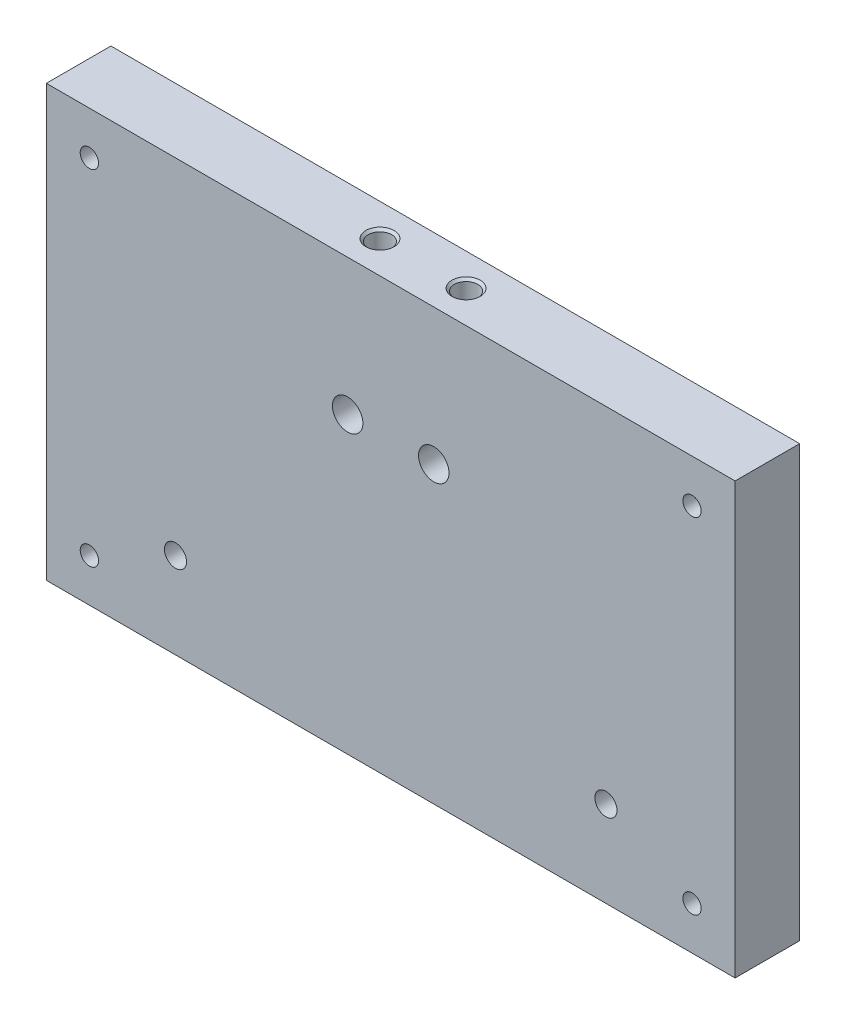
ISO-10303-21;
HEADER;
FILE_DESCRIPTION(('STEP AP214'),'2;1');
FILE_NAME('part.step','',(''),(''),'','','');
FILE_SCHEMA(('AUTOMOTIVE_DESIGN { 1 0 10303 214 1 1 1 1 }'));
ENDSEC;
DATA;
#1=APPLICATION_CONTEXT('core data for automotive mechanical design processes');
#2=APPLICATION_PROTOCOL_DEFINITION('international standard','automotive_design',2000,#1);
#3=PRODUCT_CONTEXT('',#1,'mechanical');
#4=PRODUCT('Part','Part','',(#3));
#5=PRODUCT_RELATED_PRODUCT_CATEGORY('part','',(#4));
#6=PRODUCT_DEFINITION_FORMATION('','',#4);
#7=PRODUCT_DEFINITION_CONTEXT('part definition',#1,'design');
#8=PRODUCT_DEFINITION('design','',#6,#7);
#9=PRODUCT_DEFINITION_SHAPE('','',#8);
#10=(LENGTH_UNIT() NAMED_UNIT(*) SI_UNIT(.MILLI.,.METRE.));
#11=(NAMED_UNIT(*) PLANE_ANGLE_UNIT() SI_UNIT($,.RADIAN.));
#12=(NAMED_UNIT(*) SI_UNIT($,.STERADIAN.) SOLID_ANGLE_UNIT());
#13=UNCERTAINTY_MEASURE_WITH_UNIT(LENGTH_MEASURE(1.E-05),#10,'distance_accuracy_value','');
#14=(GEOMETRIC_REPRESENTATION_CONTEXT(3) GLOBAL_UNCERTAINTY_ASSIGNED_CONTEXT((#13)) GLOBAL_UNIT_ASSIGNED_CONTEXT((#10,
#11,#12)) REPRESENTATION_CONTEXT('',''));
#15=CARTESIAN_POINT('',(0.,0.,0.));
#16=DIRECTION('',(0.,0.,1.));
#17=DIRECTION('',(1.,0.,0.));
#18=AXIS2_PLACEMENT_3D('',#15,#16,#17);
#19=CARTESIAN_POINT('',(0.,0.,9.525));
#20=DIRECTION('',(-1.,0.,0.));
#21=DIRECTION('',(0.,0.,1.));
#22=AXIS2_PLACEMENT_3D('',#19,#20,#21);
#23=PLANE('',#22);
#24=DIRECTION('',(0.,1.,0.));
#25=VECTOR('',#24,1.);
#26=CARTESIAN_POINT('',(0.,0.,0.));
#27=LINE('',#26,#25);
#28=CARTESIAN_POINT('',(0.,0.,0.));
#29=VERTEX_POINT('',#28);
#30=CARTESIAN_POINT('',(0.,63.5,0.));
#31=VERTEX_POINT('',#30);
#32=EDGE_CURVE('E107',#29,#31,#27,.T.);
#33=ORIENTED_EDGE('',*,*,#32,.T.);
#34=DIRECTION('',(0.,0.,-1.));
#35=VECTOR('',#34,1.);
#36=CARTESIAN_POINT('',(0.,63.5,9.525));
#37=LINE('',#36,#35);
#38=CARTESIAN_POINT('',(0.,63.5,9.525));
#39=VERTEX_POINT('',#38);
#40=EDGE_CURVE('E11',#39,#31,#37,.T.);
#41=ORIENTED_EDGE('',*,*,#40,.F.);
#42=DIRECTION('',(0.,1.,0.));
#43=VECTOR('',#42,1.);
#44=CARTESIAN_POINT('',(0.,0.,9.525));
#45=LINE('',#44,#43);
#46=CARTESIAN_POINT('',(0.,0.,9.525));
#47=VERTEX_POINT('',#46);
#48=EDGE_CURVE('E94',#47,#39,#45,.T.);
#49=ORIENTED_EDGE('',*,*,#48,.F.);
#50=DIRECTION('',(0.,0.,-1.));
#51=VECTOR('',#50,1.);
#52=CARTESIAN_POINT('',(0.,0.,9.525));
#53=LINE('',#52,#51);
#54=EDGE_CURVE('E103',#47,#29,#53,.T.);
#55=ORIENTED_EDGE('',*,*,#54,.T.);
#56=EDGE_LOOP('',(#33,#41,#49,#55));
#57=FACE_BOUND('',#56,.T.);
#58=ADVANCED_FACE('F37',(#57),#23,.F.);
#59=CARTESIAN_POINT('',(0.,63.5,9.525));
#60=DIRECTION('',(0.,-1.,0.));
#61=DIRECTION('',(1.,0.,0.));
#62=AXIS2_PLACEMENT_3D('',#59,#60,#61);
#63=PLANE('',#62);
#64=CARTESIAN_POINT('',(-44.45,63.5,4.7625));
#65=DIRECTION('',(0.,1.,0.));
#66=DIRECTION('',(0.,0.,1.));
#67=AXIS2_PLACEMENT_3D('',#64,#65,#66);
#68=CIRCLE('',#67,2.0828);
#69=CARTESIAN_POINT('',(-44.45,63.5,6.8453));
#70=VERTEX_POINT('',#69);
#71=EDGE_CURVE('E339',#70,#70,#68,.T.);
#72=ORIENTED_EDGE('',*,*,#71,.F.);
#73=EDGE_LOOP('',(#72));
#74=FACE_BOUND('',#73,.T.);
#75=CARTESIAN_POINT('',(-57.15,63.5,4.7625));
#76=DIRECTION('',(0.,1.,0.));
#77=DIRECTION('',(0.,0.,1.));
#78=AXIS2_PLACEMENT_3D('',#75,#76,#77);
#79=CIRCLE('',#78,2.0828);
#80=CARTESIAN_POINT('',(-57.15,63.5,6.8453));
#81=VERTEX_POINT('',#80);
#82=EDGE_CURVE('E345',#81,#81,#79,.T.);
#83=ORIENTED_EDGE('',*,*,#82,.F.);
#84=EDGE_LOOP('',(#83));
#85=FACE_BOUND('',#84,.T.);
#86=DIRECTION('',(-1.,0.,0.));
#87=VECTOR('',#86,1.);
#88=CARTESIAN_POINT('',(0.,63.5,0.));
#89=LINE('',#88,#87);
#90=CARTESIAN_POINT('',(-101.6,63.5,0.));
#91=VERTEX_POINT('',#90);
#92=EDGE_CURVE('E98',#31,#91,#89,.T.);
#93=ORIENTED_EDGE('',*,*,#92,.T.);
#94=DIRECTION('',(0.,0.,-1.));
#95=VECTOR('',#94,1.);
#96=CARTESIAN_POINT('',(-101.6,63.5,9.525));
#97=LINE('',#96,#95);
#98=CARTESIAN_POINT('',(-101.6,63.5,9.525));
#99=VERTEX_POINT('',#98);
#100=EDGE_CURVE('E50',#99,#91,#97,.T.);
#101=ORIENTED_EDGE('',*,*,#100,.F.);
#102=DIRECTION('',(-1.,0.,0.));
#103=VECTOR('',#102,1.);
#104=CARTESIAN_POINT('',(0.,63.5,9.525));
#105=LINE('',#104,#103);
#106=EDGE_CURVE('E89',#39,#99,#105,.T.);
#107=ORIENTED_EDGE('',*,*,#106,.F.);
#108=ORIENTED_EDGE('',*,*,#40,.T.);
#109=EDGE_LOOP('',(#93,#101,#107,#108));
#110=FACE_BOUND('',#109,.T.);
#111=ADVANCED_FACE('F97',(#74,#85,#110),#63,.F.);
#112=CARTESIAN_POINT('',(-101.6,0.,9.525));
#113=DIRECTION('',(1.,0.,0.));
#114=DIRECTION('',(0.,0.,-1.));
#115=AXIS2_PLACEMENT_3D('',#112,#113,#114);
#116=PLANE('',#115);
#117=DIRECTION('',(0.,-1.,0.));
#118=VECTOR('',#117,1.);
#119=CARTESIAN_POINT('',(-101.6,0.,0.));
#120=LINE('',#119,#118);
#121=CARTESIAN_POINT('',(-101.6,0.,0.));
#122=VERTEX_POINT('',#121);
#123=EDGE_CURVE('E76',#91,#122,#120,.T.);
#124=ORIENTED_EDGE('',*,*,#123,.T.);
#125=DIRECTION('',(0.,0.,-1.));
#126=VECTOR('',#125,1.);
#127=CARTESIAN_POINT('',(-101.6,0.,9.525));
#128=LINE('',#127,#126);
#129=CARTESIAN_POINT('',(-101.6,0.,9.525));
#130=VERTEX_POINT('',#129);
#131=EDGE_CURVE('E99',#130,#122,#128,.T.);
#132=ORIENTED_EDGE('',*,*,#131,.F.);
#133=DIRECTION('',(0.,-1.,0.));
#134=VECTOR('',#133,1.);
#135=CARTESIAN_POINT('',(-101.6,0.,9.525));
#136=LINE('',#135,#134);
#137=EDGE_CURVE('E92',#99,#130,#136,.T.);
#138=ORIENTED_EDGE('',*,*,#137,.F.);
#139=ORIENTED_EDGE('',*,*,#100,.T.);
#140=EDGE_LOOP('',(#124,#132,#138,#139));
#141=FACE_BOUND('',#140,.T.);
#142=ADVANCED_FACE('F101',(#141),#116,.F.);
#143=CARTESIAN_POINT('',(0.,0.,9.525));
#144=DIRECTION('',(0.,1.,0.));
#145=DIRECTION('',(-1.,0.,0.));
#146=AXIS2_PLACEMENT_3D('',#143,#144,#145);
#147=PLANE('',#146);
#148=DIRECTION('',(1.,0.,0.));
#149=VECTOR('',#148,1.);
#150=CARTESIAN_POINT('',(0.,0.,0.));
#151=LINE('',#150,#149);
#152=EDGE_CURVE('E82',#122,#29,#151,.T.);
#153=ORIENTED_EDGE('',*,*,#152,.T.);
#154=ORIENTED_EDGE('',*,*,#54,.F.);
#155=DIRECTION('',(1.,0.,0.));
#156=VECTOR('',#155,1.);
#157=CARTESIAN_POINT('',(0.,0.,9.525));
#158=LINE('',#157,#156);
#159=EDGE_CURVE('E59',#130,#47,#158,.T.);
#160=ORIENTED_EDGE('',*,*,#159,.F.);
#161=ORIENTED_EDGE('',*,*,#131,.T.);
#162=EDGE_LOOP('',(#153,#154,#160,#161));
#163=FACE_BOUND('',#162,.T.);
#164=ADVANCED_FACE('F166',(#163),#147,.F.);
#165=CARTESIAN_POINT('',(0.,0.,9.525));
#166=DIRECTION('',(0.,0.,1.));
#167=DIRECTION('',(1.,0.,0.));
#168=AXIS2_PLACEMENT_3D('',#165,#166,#167);
#169=PLANE('',#168);
#170=CARTESIAN_POINT('',(-82.55,12.7,9.525));
#171=DIRECTION('',(0.,0.,1.));
#172=DIRECTION('',(1.,0.,0.));
#173=AXIS2_PLACEMENT_3D('',#170,#171,#172);
#174=CIRCLE('',#173,1.63194999999999);
#175=CARTESIAN_POINT('',(-80.91805,12.7,9.525));
#176=VERTEX_POINT('',#175);
#177=EDGE_CURVE('E391',#176,#176,#174,.T.);
#178=ORIENTED_EDGE('',*,*,#177,.F.);
#179=EDGE_LOOP('',(#178));
#180=FACE_BOUND('',#179,.T.);
#181=CARTESIAN_POINT('',(-19.05,12.7,9.525));
#182=DIRECTION('',(0.,0.,1.));
#183=DIRECTION('',(1.,0.,0.));
#184=AXIS2_PLACEMENT_3D('',#181,#182,#183);
#185=CIRCLE('',#184,1.63195);
#186=CARTESIAN_POINT('',(-17.41805,12.7,9.525));
#187=VERTEX_POINT('',#186);
#188=EDGE_CURVE('E386',#187,#187,#185,.T.);
#189=ORIENTED_EDGE('',*,*,#188,.F.);
#190=EDGE_LOOP('',(#189));
#191=FACE_BOUND('',#190,.T.);
#192=CARTESIAN_POINT('',(-95.25,6.34999999999999,9.525));
#193=DIRECTION('',(0.,0.,1.));
#194=DIRECTION('',(1.,0.,0.));
#195=AXIS2_PLACEMENT_3D('',#192,#193,#194);
#196=CIRCLE('',#195,1.35254999999998);
#197=CARTESIAN_POINT('',(-93.89745,6.34999999999999,9.525));
#198=VERTEX_POINT('',#197);
#199=EDGE_CURVE('E380',#198,#198,#196,.T.);
#200=ORIENTED_EDGE('',*,*,#199,.F.);
#201=EDGE_LOOP('',(#200));
#202=FACE_BOUND('',#201,.T.);
#203=CARTESIAN_POINT('',(-95.25,57.15,9.525));
#204=DIRECTION('',(0.,0.,1.));
#205=DIRECTION('',(1.,0.,0.));
#206=AXIS2_PLACEMENT_3D('',#203,#204,#205);
#207=CIRCLE('',#206,1.35254999999998);
#208=CARTESIAN_POINT('',(-93.89745,57.15,9.525));
#209=VERTEX_POINT('',#208);
#210=EDGE_CURVE('E374',#209,#209,#207,.T.);
#211=ORIENTED_EDGE('',*,*,#210,.F.);
#212=EDGE_LOOP('',(#211));
#213=FACE_BOUND('',#212,.T.);
#214=CARTESIAN_POINT('',(-6.35,6.35,9.525));
#215=DIRECTION('',(0.,0.,1.));
#216=DIRECTION('',(1.,0.,0.));
#217=AXIS2_PLACEMENT_3D('',#214,#215,#216);
#218=CIRCLE('',#217,1.35254999999999);
#219=CARTESIAN_POINT('',(-4.99745000000001,6.35,9.525));
#220=VERTEX_POINT('',#219);
#221=EDGE_CURVE('E368',#220,#220,#218,.T.);
#222=ORIENTED_EDGE('',*,*,#221,.F.);
#223=EDGE_LOOP('',(#222));
#224=FACE_BOUND('',#223,.T.);
#225=CARTESIAN_POINT('',(-6.35,57.15,9.525));
#226=DIRECTION('',(0.,0.,1.));
#227=DIRECTION('',(1.,0.,0.));
#228=AXIS2_PLACEMENT_3D('',#225,#226,#227);
#229=CIRCLE('',#228,1.35254999999999);
#230=CARTESIAN_POINT('',(-4.99745000000001,57.15,9.525));
#231=VERTEX_POINT('',#230);
#232=EDGE_CURVE('E362',#231,#231,#229,.T.);
#233=ORIENTED_EDGE('',*,*,#232,.F.);
#234=EDGE_LOOP('',(#233));
#235=FACE_BOUND('',#234,.T.);
#236=CARTESIAN_POINT('',(-44.45,43.4121935388156,9.525));
#237=DIRECTION('',(0.,0.,1.));
#238=DIRECTION('',(1.,0.,0.));
#239=AXIS2_PLACEMENT_3D('',#236,#237,#238);
#240=CIRCLE('',#239,2.2479);
#241=CARTESIAN_POINT('',(-42.2021,43.4121935388156,9.525));
#242=VERTEX_POINT('',#241);
#243=EDGE_CURVE('E326',#242,#242,#240,.T.);
#244=ORIENTED_EDGE('',*,*,#243,.F.);
#245=EDGE_LOOP('',(#244));
#246=FACE_BOUND('',#245,.T.);
#247=CARTESIAN_POINT('',(-57.15,43.4121935388156,9.525));
#248=DIRECTION('',(0.,0.,1.));
#249=DIRECTION('',(1.,0.,0.));
#250=AXIS2_PLACEMENT_3D('',#247,#248,#249);
#251=CIRCLE('',#250,2.2479);
#252=CARTESIAN_POINT('',(-54.9021,43.4121935388156,9.525));
#253=VERTEX_POINT('',#252);
#254=EDGE_CURVE('E122',#253,#253,#251,.T.);
#255=ORIENTED_EDGE('',*,*,#254,.F.);
#256=EDGE_LOOP('',(#255));
#257=FACE_BOUND('',#256,.T.);
#258=ORIENTED_EDGE('',*,*,#48,.T.);
#259=ORIENTED_EDGE('',*,*,#106,.T.);
#260=ORIENTED_EDGE('',*,*,#137,.T.);
#261=ORIENTED_EDGE('',*,*,#159,.T.);
#262=EDGE_LOOP('',(#258,#259,#260,#261));
#263=FACE_BOUND('',#262,.T.);
#264=ADVANCED_FACE('F90',(#180,#191,#202,#213,#224,#235,#246,#257,#263),#169,.T.);
#265=CARTESIAN_POINT('',(0.,0.,0.));
#266=DIRECTION('',(0.,0.,1.));
#267=DIRECTION('',(1.,0.,0.));
#268=AXIS2_PLACEMENT_3D('',#265,#266,#267);
#269=PLANE('',#268);
#270=CARTESIAN_POINT('',(-82.55,12.7,0.));
#271=DIRECTION('',(0.,0.,1.));
#272=DIRECTION('',(1.,0.,0.));
#273=AXIS2_PLACEMENT_3D('',#270,#271,#272);
#274=CIRCLE('',#273,1.63194999999999);
#275=CARTESIAN_POINT('',(-80.91805,12.7,0.));
#276=VERTEX_POINT('',#275);
#277=EDGE_CURVE('E389',#276,#276,#274,.T.);
#278=ORIENTED_EDGE('',*,*,#277,.T.);
#279=EDGE_LOOP('',(#278));
#280=FACE_BOUND('',#279,.T.);
#281=CARTESIAN_POINT('',(-19.05,12.7,0.));
#282=DIRECTION('',(0.,0.,1.));
#283=DIRECTION('',(1.,0.,0.));
#284=AXIS2_PLACEMENT_3D('',#281,#282,#283);
#285=CIRCLE('',#284,1.63195);
#286=CARTESIAN_POINT('',(-17.41805,12.7,0.));
#287=VERTEX_POINT('',#286);
#288=EDGE_CURVE('E383',#287,#287,#285,.T.);
#289=ORIENTED_EDGE('',*,*,#288,.T.);
#290=EDGE_LOOP('',(#289));
#291=FACE_BOUND('',#290,.T.);
#292=CARTESIAN_POINT('',(-95.25,6.34999999999999,0.));
#293=DIRECTION('',(0.,0.,1.));
#294=DIRECTION('',(1.,0.,0.));
#295=AXIS2_PLACEMENT_3D('',#292,#293,#294);
#296=CIRCLE('',#295,1.35254999999999);
#297=CARTESIAN_POINT('',(-93.89745,6.34999999999999,0.));
#298=VERTEX_POINT('',#297);
#299=EDGE_CURVE('E377',#298,#298,#296,.T.);
#300=ORIENTED_EDGE('',*,*,#299,.T.);
#301=EDGE_LOOP('',(#300));
#302=FACE_BOUND('',#301,.T.);
#303=CARTESIAN_POINT('',(-95.25,57.15,0.));
#304=DIRECTION('',(0.,0.,1.));
#305=DIRECTION('',(1.,0.,0.));
#306=AXIS2_PLACEMENT_3D('',#303,#304,#305);
#307=CIRCLE('',#306,1.35254999999999);
#308=CARTESIAN_POINT('',(-93.89745,57.15,0.));
#309=VERTEX_POINT('',#308);
#310=EDGE_CURVE('E371',#309,#309,#307,.T.);
#311=ORIENTED_EDGE('',*,*,#310,.T.);
#312=EDGE_LOOP('',(#311));
#313=FACE_BOUND('',#312,.T.);
#314=CARTESIAN_POINT('',(-6.35,6.35,0.));
#315=DIRECTION('',(0.,0.,1.));
#316=DIRECTION('',(1.,0.,0.));
#317=AXIS2_PLACEMENT_3D('',#314,#315,#316);
#318=CIRCLE('',#317,1.35255);
#319=CARTESIAN_POINT('',(-4.99745,6.35,0.));
#320=VERTEX_POINT('',#319);
#321=EDGE_CURVE('E365',#320,#320,#318,.T.);
#322=ORIENTED_EDGE('',*,*,#321,.T.);
#323=EDGE_LOOP('',(#322));
#324=FACE_BOUND('',#323,.T.);
#325=CARTESIAN_POINT('',(-6.35,57.15,0.));
#326=DIRECTION('',(0.,0.,1.));
#327=DIRECTION('',(1.,0.,0.));
#328=AXIS2_PLACEMENT_3D('',#325,#326,#327);
#329=CIRCLE('',#328,1.35255);
#330=CARTESIAN_POINT('',(-4.99745,57.15,0.));
#331=VERTEX_POINT('',#330);
#332=EDGE_CURVE('E359',#331,#331,#329,.T.);
#333=ORIENTED_EDGE('',*,*,#332,.T.);
#334=EDGE_LOOP('',(#333));
#335=FACE_BOUND('',#334,.T.);
#336=CARTESIAN_POINT('',(-44.45,43.4121935388156,0.));
#337=DIRECTION('',(0.,0.,1.));
#338=DIRECTION('',(1.,0.,0.));
#339=AXIS2_PLACEMENT_3D('',#336,#337,#338);
#340=CIRCLE('',#339,2.2479);
#341=CARTESIAN_POINT('',(-42.2021,43.4121935388156,0.));
#342=VERTEX_POINT('',#341);
#343=EDGE_CURVE('E329',#342,#342,#340,.T.);
#344=ORIENTED_EDGE('',*,*,#343,.T.);
#345=EDGE_LOOP('',(#344));
#346=FACE_BOUND('',#345,.T.);
#347=CARTESIAN_POINT('',(-57.15,43.4121935388156,0.));
#348=DIRECTION('',(0.,0.,1.));
#349=DIRECTION('',(1.,0.,0.));
#350=AXIS2_PLACEMENT_3D('',#347,#348,#349);
#351=CIRCLE('',#350,2.2479);
#352=CARTESIAN_POINT('',(-54.9021,43.4121935388156,0.));
#353=VERTEX_POINT('',#352);
#354=EDGE_CURVE('E121',#353,#353,#351,.T.);
#355=ORIENTED_EDGE('',*,*,#354,.T.);
#356=EDGE_LOOP('',(#355));
#357=FACE_BOUND('',#356,.T.);
#358=ORIENTED_EDGE('',*,*,#32,.F.);
#359=ORIENTED_EDGE('',*,*,#152,.F.);
#360=ORIENTED_EDGE('',*,*,#123,.F.);
#361=ORIENTED_EDGE('',*,*,#92,.F.);
#362=EDGE_LOOP('',(#358,#359,#360,#361));
#363=FACE_BOUND('',#362,.T.);
#364=ADVANCED_FACE('F148',(#280,#291,#302,#313,#324,#335,#346,#357,#363),#269,.F.);
#365=CARTESIAN_POINT('',(-57.15,63.5,4.7625));
#366=DIRECTION('',(0.,1.,0.));
#367=DIRECTION('',(0.,0.,1.));
#368=AXIS2_PLACEMENT_3D('',#365,#366,#367);
#369=CYLINDRICAL_SURFACE('',#368,1.7272);
#370=CARTESIAN_POINT('',(-57.15,45.6600935388156,6.4897));
#371=CARTESIAN_POINT('',(-57.2338587410568,45.660086904255,6.48969312604297));
#372=CARTESIAN_POINT('',(-57.3178007097025,45.6553545921181,6.48354623436465));
#373=CARTESIAN_POINT('',(-57.482983545752,45.6368544226834,6.45936168885248));
#374=CARTESIAN_POINT('',(-57.564219807188,45.6230719102294,6.4413047486447));
#375=CARTESIAN_POINT('',(-57.7212109052852,45.5877880246278,6.39455705136511));
#376=CARTESIAN_POINT('',(-57.7969948117855,45.5663319025046,6.36592860262387));
#377=CARTESIAN_POINT('',(-57.9421572992914,45.5172873642362,6.29940904803436));
#378=CARTESIAN_POINT('',(-58.0115362630018,45.4896993148187,6.26151849610453));
#379=CARTESIAN_POINT('',(-58.1493250995929,45.4272979612141,6.17383002268563));
#380=CARTESIAN_POINT('',(-58.2170357260977,45.3920499657781,6.12324928318421));
#381=CARTESIAN_POINT('',(-58.3435539193056,45.3184601313201,6.01376408652045));
#382=CARTESIAN_POINT('',(-58.4023483646323,45.2801138574619,5.95484760379498));
#383=CARTESIAN_POINT('',(-58.522282918305,45.1944409174577,5.81615065068791));
#384=CARTESIAN_POINT('',(-58.5812575240503,45.1469404095441,5.734598701262));
#385=CARTESIAN_POINT('',(-58.6849513562198,45.0558815988741,5.56084877572078));
#386=CARTESIAN_POINT('',(-58.7296874065091,45.0123186874931,5.46866354045663));
#387=CARTESIAN_POINT('',(-58.7900606235057,44.9498654563105,5.30832591115649));
#388=CARTESIAN_POINT('',(-58.8103917039639,44.9277024329169,5.24323328028774));
#389=CARTESIAN_POINT('',(-58.8434460374248,44.8906769691249,5.10920362861217));
#390=CARTESIAN_POINT('',(-58.8561871439236,44.8757974110462,5.04027604988117));
#391=CARTESIAN_POINT('',(-58.8732615259641,44.8556672049597,4.89916501610035));
#392=CARTESIAN_POINT('',(-58.877505063932,44.8505193590108,4.82695496306086));
#393=CARTESIAN_POINT('',(-58.876860526688,44.8512929576657,4.68262666503324));
#394=CARTESIAN_POINT('',(-58.8719716244093,44.8572154048352,4.6105084289523));
#395=CARTESIAN_POINT('',(-58.8547260577637,44.877492682559,4.4778045949731));
#396=CARTESIAN_POINT('',(-58.8433719539129,44.8907092527734,4.4168988562289));
#397=CARTESIAN_POINT('',(-58.8147154393665,44.9229029254255,4.29808359641079));
#398=CARTESIAN_POINT('',(-58.7974065878164,44.9418862627797,4.24017739809542));
#399=CARTESIAN_POINT('',(-58.7443913991846,44.9975131251712,4.09102316987051));
#400=CARTESIAN_POINT('',(-58.7040534442491,45.0375919011801,4.00270760117155));
#401=CARTESIAN_POINT('',(-58.6104866123808,45.1221761162231,3.83545283073585));
#402=CARTESIAN_POINT('',(-58.5572249998136,45.1666926245992,3.75653821068905));
#403=CARTESIAN_POINT('',(-58.436588888252,45.2570819785916,3.60599680895956));
#404=CARTESIAN_POINT('',(-58.368814115099,45.3029521909512,3.53468774975973));
#405=CARTESIAN_POINT('',(-58.2207196149448,45.3905760055162,3.40363199358154));
#406=CARTESIAN_POINT('',(-58.1404227111641,45.4323368760179,3.34386469531415));
#407=CARTESIAN_POINT('',(-57.9837738505528,45.5011643912926,3.24761678211482));
#408=CARTESIAN_POINT('',(-57.9093850147246,45.5295216417677,3.2088764756708));
#409=CARTESIAN_POINT('',(-57.7537035464139,45.5790464814958,3.1420301183691));
#410=CARTESIAN_POINT('',(-57.672414838484,45.6002181240198,3.11391807128019));
#411=CARTESIAN_POINT('',(-57.5041740263861,45.6336825126222,3.06975411346075));
#412=CARTESIAN_POINT('',(-57.4171861503527,45.645911843363,3.05378830745377));
#413=CARTESIAN_POINT('',(-57.2409694820482,45.6599863863113,3.0354288236251));
#414=CARTESIAN_POINT('',(-57.1517421166426,45.6618380498904,3.03302671380071));
#415=CARTESIAN_POINT('',(-56.9846886385171,45.6553836480959,3.04143338103207));
#416=CARTESIAN_POINT('',(-56.906735318567,45.6482253820798,3.05074927760055));
#417=CARTESIAN_POINT('',(-56.7538588527044,45.6262603266978,3.0795431434207));
#418=CARTESIAN_POINT('',(-56.6789362245479,45.6114522363556,3.09902284119669));
#419=CARTESIAN_POINT('',(-56.5325065585192,45.5749599305833,3.14757439599706));
#420=CARTESIAN_POINT('',(-56.4610853070559,45.553156710711,3.17681264533635));
#421=CARTESIAN_POINT('',(-56.3242519629292,45.504197937889,3.24356561007769));
#422=CARTESIAN_POINT('',(-56.2588408629212,45.477041503107,3.28108168920411));
#423=CARTESIAN_POINT('',(-56.124585956842,45.4141731411896,3.36993637006007));
#424=CARTESIAN_POINT('',(-56.056890699999,45.3777877654858,3.42252850178317));
#425=CARTESIAN_POINT('',(-55.9307257199699,45.3021277922577,3.53619762696585));
#426=CARTESIAN_POINT('',(-55.8722732112681,45.2628479987523,3.59729006354027));
#427=CARTESIAN_POINT('',(-55.7538717457043,45.1758023187386,3.74054577584215));
#428=CARTESIAN_POINT('',(-55.6960902118931,45.1279535396926,3.82445799456166));
#429=CARTESIAN_POINT('',(-55.5952965394909,45.0371616109442,4.00315408040512));
#430=CARTESIAN_POINT('',(-55.5522577439943,44.9942097018897,4.09791790774282));
#431=CARTESIAN_POINT('',(-55.4960855545295,44.9348966925771,4.26037216706615));
#432=CARTESIAN_POINT('',(-55.4777934504767,44.9146122858317,4.32482580212366));
#433=CARTESIAN_POINT('',(-55.4486549094326,44.8815363831526,4.45718781226999));
#434=CARTESIAN_POINT('',(-55.437790339149,44.868726650132,4.52508733574435));
#435=CARTESIAN_POINT('',(-55.4242295328618,44.8526434317699,4.66350200606323));
#436=CARTESIAN_POINT('',(-55.4216066863791,44.8494556360684,4.73403502512876));
#437=CARTESIAN_POINT('',(-55.4250060378156,44.8535307464002,4.87460523288236));
#438=CARTESIAN_POINT('',(-55.4310337168646,44.8608002783929,4.94464207892254));
#439=CARTESIAN_POINT('',(-55.4523003610492,44.8856771345953,5.0896087014841));
#440=CARTESIAN_POINT('',(-55.4684978596906,44.9043538508375,5.16420452961272));
#441=CARTESIAN_POINT('',(-55.5096478847757,44.9494724340902,5.3085105132186));
#442=CARTESIAN_POINT('',(-55.534623659396,44.9759348900524,5.3782070996473));
#443=CARTESIAN_POINT('',(-55.6044511043617,45.0454898069933,5.54048662174001));
#444=CARTESIAN_POINT('',(-55.6532443092734,45.0908958038255,5.63036770098031));
#445=CARTESIAN_POINT('',(-55.764968416866,45.184218708349,5.79941089060643));
#446=CARTESIAN_POINT('',(-55.8279180031055,45.2321388695563,5.87855861179797));
#447=CARTESIAN_POINT('',(-55.9689246554768,45.3267394144311,6.02700582011919));
#448=CARTESIAN_POINT('',(-56.0472743747089,45.3733718020639,6.09606024449322));
#449=CARTESIAN_POINT('',(-56.2175828887103,45.4598070961633,6.22018922962522));
#450=CARTESIAN_POINT('',(-56.3095116740699,45.4996246546895,6.27529390818552));
#451=CARTESIAN_POINT('',(-56.4793467049826,45.5590761469812,6.35617532596232));
#452=CARTESIAN_POINT('',(-56.5545075552948,45.5812624020037,6.3858542615825));
#453=CARTESIAN_POINT('',(-56.7098827532914,45.6180224318158,6.43465663578117));
#454=CARTESIAN_POINT('',(-56.7900856065726,45.6326128647271,6.45380317784225));
#455=CARTESIAN_POINT('',(-56.9174756623903,45.6485131486866,6.47460723441107));
#456=CARTESIAN_POINT('',(-56.9636789570766,45.6528415514883,6.48025286575565));
#457=CARTESIAN_POINT('',(-57.0565794813871,45.6586339250205,6.48780159493144));
#458=CARTESIAN_POINT('',(-57.103276822393,45.6600972353623,6.48970382993008));
#459=CARTESIAN_POINT('',(-57.15,45.6600935388156,6.4897));
#460=B_SPLINE_CURVE_WITH_KNOTS('',3,(#370,#371,#372,#373,#374,#375,#376,#377,#378,#379,#380,
#381,#382,#383,#384,#385,#386,#387,#388,#389,#390,#391,#392,#393,#394,#395,#396,#397,#398,#399,
#400,#401,#402,#403,#404,#405,#406,#407,#408,#409,#410,#411,#412,#413,#414,#415,#416,#417,#418,
#419,#420,#421,#422,#423,#424,#425,#426,#427,#428,#429,#430,#431,#432,#433,#434,#435,#436,#437,
#438,#439,#440,#441,#442,#443,#444,#445,#446,#447,#448,#449,#450,#451,#452,#453,#454,#455,#456,
#457,#458,#459),.UNSPECIFIED.,.T.,.F.,(4,2,2,2,2,2,2,2,2,2,2,2,2,2,2,2,2,2,2,2,2,2,2,2,2,2,2,2,
2,2,2,2,2,2,2,2,2,2,2,2,2,2,2,2,4),(0.,0.251377647963262,0.503163363560239,0.753488147133667,
1.00379796373903,1.27754956594077,1.5517002010665,1.88421693999147,2.2163393155103,
2.43076881398845,2.64469190889993,2.8608624450495,3.0770525593315,3.26640057633202,
3.45595404577309,3.76934397398978,4.08353616146981,4.40787661631742,4.73163268232424,
4.9961925240482,5.26060288337365,5.52687061759846,5.79297280567576,6.02835979102068,
6.26378682091261,6.50345272550828,6.74315814318815,7.02153345723681,7.3004212848789,
7.63670071162247,7.97236884888696,8.18168109612678,8.39048049402958,8.6011339804731,
8.8119209997279,9.04638269788552,9.28147007670804,9.61542353060051,9.94982034944547,
10.2913243064109,10.632084536869,10.8824876559646,11.1323392868577,11.2723659088719,
11.4124248024853),.UNSPECIFIED.);
#461=CARTESIAN_POINT('',(-57.15,45.6600935388156,6.4897));
#462=VERTEX_POINT('',#461);
#463=EDGE_CURVE('E115',#462,#462,#460,.T.);
#464=ORIENTED_EDGE('',*,*,#463,.T.);
#465=EDGE_LOOP('',(#464));
#466=FACE_BOUND('',#465,.T.);
#467=CARTESIAN_POINT('',(-57.15,63.1444,4.7625));
#468=DIRECTION('',(0.,1.,0.));
#469=DIRECTION('',(0.,0.,1.));
#470=AXIS2_PLACEMENT_3D('',#467,#468,#469);
#471=CIRCLE('',#470,1.7272);
#472=CARTESIAN_POINT('',(-57.15,63.1444,6.4897));
#473=VERTEX_POINT('',#472);
#474=EDGE_CURVE('E110',#473,#473,#471,.T.);
#475=ORIENTED_EDGE('',*,*,#474,.T.);
#476=EDGE_LOOP('',(#475));
#477=FACE_BOUND('',#476,.T.);
#478=ADVANCED_FACE('F123',(#466,#477),#369,.F.);
#479=CARTESIAN_POINT('',(-57.15,63.5,4.7625));
#480=DIRECTION('',(0.,1.,0.));
#481=DIRECTION('',(0.,0.,1.));
#482=AXIS2_PLACEMENT_3D('',#479,#480,#481);
#483=CONICAL_SURFACE('',#482,2.0828,0.785398163397458);
#484=ORIENTED_EDGE('',*,*,#474,.F.);
#485=EDGE_LOOP('',(#484));
#486=FACE_BOUND('',#485,.T.);
#487=ORIENTED_EDGE('',*,*,#82,.T.);
#488=EDGE_LOOP('',(#487));
#489=FACE_BOUND('',#488,.T.);
#490=ADVANCED_FACE('F141',(#486,#489),#483,.F.);
#491=CARTESIAN_POINT('',(-44.45,63.5,4.7625));
#492=DIRECTION('',(0.,1.,0.));
#493=DIRECTION('',(0.,0.,1.));
#494=AXIS2_PLACEMENT_3D('',#491,#492,#493);
#495=CYLINDRICAL_SURFACE('',#494,1.7272);
#496=CARTESIAN_POINT('',(-44.45,45.6600935388156,6.4897));
#497=CARTESIAN_POINT('',(-44.5338587410568,45.660086904255,6.48969312604296));
#498=CARTESIAN_POINT('',(-44.6178007097025,45.6553545921181,6.48354623436465));
#499=CARTESIAN_POINT('',(-44.782983545752,45.6368544226835,6.45936168885248));
#500=CARTESIAN_POINT('',(-44.864219807188,45.6230719102294,6.4413047486447));
#501=CARTESIAN_POINT('',(-45.0212109052852,45.5877880246278,6.39455705136511));
#502=CARTESIAN_POINT('',(-45.0969948117855,45.5663319025047,6.36592860262387));
#503=CARTESIAN_POINT('',(-45.2421572992914,45.5172873642362,6.29940904803436));
#504=CARTESIAN_POINT('',(-45.3115362630018,45.4896993148187,6.26151849610452));
#505=CARTESIAN_POINT('',(-45.4493250995929,45.4272979612142,6.17383002268563));
#506=CARTESIAN_POINT('',(-45.5170357260977,45.3920499657781,6.12324928318421));
#507=CARTESIAN_POINT('',(-45.6435539193056,45.3184601313201,6.01376408652045));
#508=CARTESIAN_POINT('',(-45.7023483646323,45.280113857462,5.95484760379497));
#509=CARTESIAN_POINT('',(-45.822282918305,45.1944409174577,5.81615065068791));
#510=CARTESIAN_POINT('',(-45.8812575240503,45.1469404095441,5.734598701262));
#511=CARTESIAN_POINT('',(-45.9849513562198,45.0558815988741,5.56084877572078));
#512=CARTESIAN_POINT('',(-46.0296874065091,45.0123186874931,5.46866354045663));
#513=CARTESIAN_POINT('',(-46.0900606235057,44.9498654563105,5.30832591115649));
#514=CARTESIAN_POINT('',(-46.1103917039639,44.9277024329169,5.24323328028774));
#515=CARTESIAN_POINT('',(-46.1434460374248,44.8906769691249,5.10920362861217));
#516=CARTESIAN_POINT('',(-46.1561871439236,44.8757974110462,5.04027604988117));
#517=CARTESIAN_POINT('',(-46.1732615259641,44.8556672049597,4.89916501610035));
#518=CARTESIAN_POINT('',(-46.177505063932,44.8505193590108,4.82695496306085));
#519=CARTESIAN_POINT('',(-46.176860526688,44.8512929576657,4.68262666503324));
#520=CARTESIAN_POINT('',(-46.1719716244093,44.8572154048352,4.61050842895229));
#521=CARTESIAN_POINT('',(-46.1547260577637,44.877492682559,4.47780459497309));
#522=CARTESIAN_POINT('',(-46.1433719539128,44.8907092527734,4.41689885622889));
#523=CARTESIAN_POINT('',(-46.1147154393665,44.9229029254255,4.29808359641079));
#524=CARTESIAN_POINT('',(-46.0974065878164,44.9418862627797,4.24017739809542));
#525=CARTESIAN_POINT('',(-46.0443913991846,44.9975131251712,4.09102316987051));
#526=CARTESIAN_POINT('',(-46.0040534442491,45.0375919011801,4.00270760117155));
#527=CARTESIAN_POINT('',(-45.9104866123808,45.1221761162232,3.83545283073585));
#528=CARTESIAN_POINT('',(-45.8572249998136,45.1666926245992,3.75653821068904));
#529=CARTESIAN_POINT('',(-45.736588888252,45.2570819785916,3.60599680895956));
#530=CARTESIAN_POINT('',(-45.668814115099,45.3029521909512,3.53468774975973));
#531=CARTESIAN_POINT('',(-45.5207196149448,45.3905760055162,3.40363199358154));
#532=CARTESIAN_POINT('',(-45.4404227111641,45.4323368760179,3.34386469531415));
#533=CARTESIAN_POINT('',(-45.2837738505528,45.5011643912926,3.24761678211482));
#534=CARTESIAN_POINT('',(-45.2093850147246,45.5295216417677,3.20887647567079));
#535=CARTESIAN_POINT('',(-45.0537035464139,45.5790464814959,3.14203011836909));
#536=CARTESIAN_POINT('',(-44.972414838484,45.6002181240198,3.11391807128019));
#537=CARTESIAN_POINT('',(-44.8041740263861,45.6336825126222,3.06975411346075));
#538=CARTESIAN_POINT('',(-44.7171861503527,45.645911843363,3.05378830745376));
#539=CARTESIAN_POINT('',(-44.5409694820482,45.6599863863113,3.0354288236251));
#540=CARTESIAN_POINT('',(-44.4517421166426,45.6618380498904,3.0330267138007));
#541=CARTESIAN_POINT('',(-44.2846886385171,45.6553836480959,3.04143338103206));
#542=CARTESIAN_POINT('',(-44.2067353185669,45.6482253820798,3.05074927760055));
#543=CARTESIAN_POINT('',(-44.0538588527044,45.6262603266979,3.07954314342069));
#544=CARTESIAN_POINT('',(-43.9789362245479,45.6114522363556,3.09902284119669));
#545=CARTESIAN_POINT('',(-43.8325065585192,45.5749599305834,3.14757439599706));
#546=CARTESIAN_POINT('',(-43.7610853070559,45.553156710711,3.17681264533634));
#547=CARTESIAN_POINT('',(-43.6242519629292,45.504197937889,3.24356561007769));
#548=CARTESIAN_POINT('',(-43.5588408629212,45.477041503107,3.28108168920411));
#549=CARTESIAN_POINT('',(-43.424585956842,45.4141731411896,3.36993637006007));
#550=CARTESIAN_POINT('',(-43.356890699999,45.3777877654858,3.42252850178317));
#551=CARTESIAN_POINT('',(-43.2307257199699,45.3021277922577,3.53619762696585));
#552=CARTESIAN_POINT('',(-43.1722732112681,45.2628479987523,3.59729006354027));
#553=CARTESIAN_POINT('',(-43.0538717457043,45.1758023187386,3.74054577584214));
#554=CARTESIAN_POINT('',(-42.9960902118931,45.1279535396927,3.82445799456166));
#555=CARTESIAN_POINT('',(-42.8952965394909,45.0371616109442,4.00315408040512));
#556=CARTESIAN_POINT('',(-42.8522577439943,44.9942097018897,4.09791790774282));
#557=CARTESIAN_POINT('',(-42.7960855545295,44.9348966925771,4.26037216706615));
#558=CARTESIAN_POINT('',(-42.7777934504767,44.9146122858317,4.32482580212366));
#559=CARTESIAN_POINT('',(-42.7486549094326,44.8815363831526,4.45718781226999));
#560=CARTESIAN_POINT('',(-42.737790339149,44.868726650132,4.52508733574434));
#561=CARTESIAN_POINT('',(-42.7242295328618,44.8526434317699,4.66350200606322));
#562=CARTESIAN_POINT('',(-42.7216066863791,44.8494556360684,4.73403502512875));
#563=CARTESIAN_POINT('',(-42.7250060378156,44.8535307464003,4.87460523288236));
#564=CARTESIAN_POINT('',(-42.7310337168646,44.8608002783929,4.94464207892254));
#565=CARTESIAN_POINT('',(-42.7523003610492,44.8856771345954,5.08960870148409));
#566=CARTESIAN_POINT('',(-42.7684978596906,44.9043538508375,5.16420452961272));
#567=CARTESIAN_POINT('',(-42.8096478847757,44.9494724340902,5.3085105132186));
#568=CARTESIAN_POINT('',(-42.834623659396,44.9759348900524,5.3782070996473));
#569=CARTESIAN_POINT('',(-42.9044511043617,45.0454898069933,5.54048662174001));
#570=CARTESIAN_POINT('',(-42.9532443092734,45.0908958038255,5.63036770098031));
#571=CARTESIAN_POINT('',(-43.064968416866,45.184218708349,5.79941089060643));
#572=CARTESIAN_POINT('',(-43.1279180031055,45.2321388695564,5.87855861179796));
#573=CARTESIAN_POINT('',(-43.2689246554768,45.3267394144311,6.02700582011919));
#574=CARTESIAN_POINT('',(-43.3472743747089,45.373371802064,6.09606024449321));
#575=CARTESIAN_POINT('',(-43.5175828887103,45.4598070961633,6.22018922962521));
#576=CARTESIAN_POINT('',(-43.6095116740699,45.4996246546895,6.27529390818552));
#577=CARTESIAN_POINT('',(-43.7793467049826,45.5590761469812,6.35617532596232));
#578=CARTESIAN_POINT('',(-43.8545075552948,45.5812624020037,6.3858542615825));
#579=CARTESIAN_POINT('',(-44.0098827532914,45.6180224318158,6.43465663578117));
#580=CARTESIAN_POINT('',(-44.0900856065726,45.6326128647271,6.45380317784224));
#581=CARTESIAN_POINT('',(-44.2174756623902,45.6485131486866,6.47460723441107));
#582=CARTESIAN_POINT('',(-44.2636789570766,45.6528415514883,6.48025286575565));
#583=CARTESIAN_POINT('',(-44.3565794813871,45.6586339250205,6.48780159493144));
#584=CARTESIAN_POINT('',(-44.403276822393,45.6600972353623,6.48970382993008));
#585=CARTESIAN_POINT('',(-44.45,45.6600935388156,6.4897));
#586=B_SPLINE_CURVE_WITH_KNOTS('',3,(#496,#497,#498,#499,#500,#501,#502,#503,#504,#505,#506,
#507,#508,#509,#510,#511,#512,#513,#514,#515,#516,#517,#518,#519,#520,#521,#522,#523,#524,#525,
#526,#527,#528,#529,#530,#531,#532,#533,#534,#535,#536,#537,#538,#539,#540,#541,#542,#543,#544,
#545,#546,#547,#548,#549,#550,#551,#552,#553,#554,#555,#556,#557,#558,#559,#560,#561,#562,#563,
#564,#565,#566,#567,#568,#569,#570,#571,#572,#573,#574,#575,#576,#577,#578,#579,#580,#581,#582,
#583,#584,#585),.UNSPECIFIED.,.T.,.F.,(4,2,2,2,2,2,2,2,2,2,2,2,2,2,2,2,2,2,2,2,2,2,2,2,2,2,2,2,
2,2,2,2,2,2,2,2,2,2,2,2,2,2,2,2,4),(0.,0.251377647963262,0.503163363560239,0.753488147133667,
1.00379796373903,1.27754956594076,1.5517002010665,1.88421693999147,2.2163393155103,
2.43076881398845,2.64469190889993,2.8608624450495,3.0770525593315,3.26640057633203,
3.45595404577309,3.76934397398977,4.08353616146981,4.40787661631742,4.73163268232424,
4.99619252404821,5.26060288337365,5.52687061759846,5.79297280567576,6.02835979102068,
6.2637868209126,6.50345272550828,6.74315814318814,7.02153345723681,7.30042128487889,
7.63670071162247,7.97236884888696,8.18168109612678,8.39048049402958,8.6011339804731,
8.8119209997279,9.04638269788552,9.28147007670804,9.61542353060051,9.94982034944547,
10.2913243064109,10.632084536869,10.8824876559646,11.1323392868577,11.2723659088719,
11.4124248024853),.UNSPECIFIED.);
#587=CARTESIAN_POINT('',(-44.45,45.6600935388156,6.4897));
#588=VERTEX_POINT('',#587);
#589=EDGE_CURVE('E40',#588,#588,#586,.T.);
#590=ORIENTED_EDGE('',*,*,#589,.T.);
#591=EDGE_LOOP('',(#590));
#592=FACE_BOUND('',#591,.T.);
#593=CARTESIAN_POINT('',(-44.45,63.1444,4.7625));
#594=DIRECTION('',(0.,1.,0.));
#595=DIRECTION('',(0.,0.,1.));
#596=AXIS2_PLACEMENT_3D('',#593,#594,#595);
#597=CIRCLE('',#596,1.7272);
#598=CARTESIAN_POINT('',(-44.45,63.1444,6.4897));
#599=VERTEX_POINT('',#598);
#600=EDGE_CURVE('E342',#599,#599,#597,.T.);
#601=ORIENTED_EDGE('',*,*,#600,.T.);
#602=EDGE_LOOP('',(#601));
#603=FACE_BOUND('',#602,.T.);
#604=ADVANCED_FACE('F137',(#592,#603),#495,.F.);
#605=CARTESIAN_POINT('',(-44.45,63.5,4.7625));
#606=DIRECTION('',(0.,1.,0.));
#607=DIRECTION('',(0.,0.,1.));
#608=AXIS2_PLACEMENT_3D('',#605,#606,#607);
#609=CONICAL_SURFACE('',#608,2.0828,0.785398163397439);
#610=ORIENTED_EDGE('',*,*,#600,.F.);
#611=EDGE_LOOP('',(#610));
#612=FACE_BOUND('',#611,.T.);
#613=ORIENTED_EDGE('',*,*,#71,.T.);
#614=EDGE_LOOP('',(#613));
#615=FACE_BOUND('',#614,.T.);
#616=ADVANCED_FACE('F132',(#612,#615),#609,.F.);
#617=CARTESIAN_POINT('',(-57.15,43.4121935388156,9.525));
#618=DIRECTION('',(0.,0.,1.));
#619=DIRECTION('',(1.,0.,0.));
#620=AXIS2_PLACEMENT_3D('',#617,#618,#619);
#621=CYLINDRICAL_SURFACE('',#620,2.2479);
#622=ORIENTED_EDGE('',*,*,#463,.F.);
#623=EDGE_LOOP('',(#622));
#624=FACE_BOUND('',#623,.T.);
#625=ORIENTED_EDGE('',*,*,#254,.T.);
#626=EDGE_LOOP('',(#625));
#627=FACE_BOUND('',#626,.T.);
#628=ORIENTED_EDGE('',*,*,#354,.F.);
#629=EDGE_LOOP('',(#628));
#630=FACE_BOUND('',#629,.T.);
#631=ADVANCED_FACE('F127',(#624,#627,#630),#621,.F.);
#632=CARTESIAN_POINT('',(-44.45,43.4121935388156,9.525));
#633=DIRECTION('',(0.,0.,1.));
#634=DIRECTION('',(1.,0.,0.));
#635=AXIS2_PLACEMENT_3D('',#632,#633,#634);
#636=CYLINDRICAL_SURFACE('',#635,2.2479);
#637=ORIENTED_EDGE('',*,*,#589,.F.);
#638=EDGE_LOOP('',(#637));
#639=FACE_BOUND('',#638,.T.);
#640=ORIENTED_EDGE('',*,*,#243,.T.);
#641=EDGE_LOOP('',(#640));
#642=FACE_BOUND('',#641,.T.);
#643=ORIENTED_EDGE('',*,*,#343,.F.);
#644=EDGE_LOOP('',(#643));
#645=FACE_BOUND('',#644,.T.);
#646=ADVANCED_FACE('F131',(#639,#642,#645),#636,.F.);
#647=CARTESIAN_POINT('',(-6.35,57.15,9.525));
#648=DIRECTION('',(0.,0.,1.));
#649=DIRECTION('',(1.,0.,0.));
#650=AXIS2_PLACEMENT_3D('',#647,#648,#649);
#651=CYLINDRICAL_SURFACE('',#650,1.35254999999999);
#652=ORIENTED_EDGE('',*,*,#332,.F.);
#653=EDGE_LOOP('',(#652));
#654=FACE_BOUND('',#653,.T.);
#655=ORIENTED_EDGE('',*,*,#232,.T.);
#656=EDGE_LOOP('',(#655));
#657=FACE_BOUND('',#656,.T.);
#658=ADVANCED_FACE('F225',(#654,#657),#651,.F.);
#659=CARTESIAN_POINT('',(-6.35,6.35,9.525));
#660=DIRECTION('',(0.,0.,1.));
#661=DIRECTION('',(1.,0.,0.));
#662=AXIS2_PLACEMENT_3D('',#659,#660,#661);
#663=CYLINDRICAL_SURFACE('',#662,1.35254999999999);
#664=ORIENTED_EDGE('',*,*,#321,.F.);
#665=EDGE_LOOP('',(#664));
#666=FACE_BOUND('',#665,.T.);
#667=ORIENTED_EDGE('',*,*,#221,.T.);
#668=EDGE_LOOP('',(#667));
#669=FACE_BOUND('',#668,.T.);
#670=ADVANCED_FACE('F230',(#666,#669),#663,.F.);
#671=CARTESIAN_POINT('',(-95.25,57.15,9.525));
#672=DIRECTION('',(0.,0.,1.));
#673=DIRECTION('',(1.,0.,0.));
#674=AXIS2_PLACEMENT_3D('',#671,#672,#673);
#675=CYLINDRICAL_SURFACE('',#674,1.35254999999999);
#676=ORIENTED_EDGE('',*,*,#310,.F.);
#677=EDGE_LOOP('',(#676));
#678=FACE_BOUND('',#677,.T.);
#679=ORIENTED_EDGE('',*,*,#210,.T.);
#680=EDGE_LOOP('',(#679));
#681=FACE_BOUND('',#680,.T.);
#682=ADVANCED_FACE('F241',(#678,#681),#675,.F.);
#683=CARTESIAN_POINT('',(-95.25,6.34999999999999,9.525));
#684=DIRECTION('',(0.,0.,1.));
#685=DIRECTION('',(1.,0.,0.));
#686=AXIS2_PLACEMENT_3D('',#683,#684,#685);
#687=CYLINDRICAL_SURFACE('',#686,1.35254999999999);
#688=ORIENTED_EDGE('',*,*,#299,.F.);
#689=EDGE_LOOP('',(#688));
#690=FACE_BOUND('',#689,.T.);
#691=ORIENTED_EDGE('',*,*,#199,.T.);
#692=EDGE_LOOP('',(#691));
#693=FACE_BOUND('',#692,.T.);
#694=ADVANCED_FACE('F192',(#690,#693),#687,.F.);
#695=CARTESIAN_POINT('',(-19.05,12.7,9.525));
#696=DIRECTION('',(0.,0.,1.));
#697=DIRECTION('',(1.,0.,0.));
#698=AXIS2_PLACEMENT_3D('',#695,#696,#697);
#699=CYLINDRICAL_SURFACE('',#698,1.63195);
#700=ORIENTED_EDGE('',*,*,#288,.F.);
#701=EDGE_LOOP('',(#700));
#702=FACE_BOUND('',#701,.T.);
#703=ORIENTED_EDGE('',*,*,#188,.T.);
#704=EDGE_LOOP('',(#703));
#705=FACE_BOUND('',#704,.T.);
#706=ADVANCED_FACE('F202',(#702,#705),#699,.F.);
#707=CARTESIAN_POINT('',(-82.55,12.7,9.525));
#708=DIRECTION('',(0.,0.,1.));
#709=DIRECTION('',(1.,0.,0.));
#710=AXIS2_PLACEMENT_3D('',#707,#708,#709);
#711=CYLINDRICAL_SURFACE('',#710,1.63194999999999);
#712=ORIENTED_EDGE('',*,*,#277,.F.);
#713=EDGE_LOOP('',(#712));
#714=FACE_BOUND('',#713,.T.);
#715=ORIENTED_EDGE('',*,*,#177,.T.);
#716=EDGE_LOOP('',(#715));
#717=FACE_BOUND('',#716,.T.);
#718=ADVANCED_FACE('F208',(#714,#717),#711,.F.);
#719=CLOSED_SHELL('',(#58,#111,#142,#164,#264,#364,#478,#490,#604,#616,#631,#646,#658,#670,#682,
#694,#706,#718));
#720=MANIFOLD_SOLID_BREP('B2',#719);
#721=ADVANCED_BREP_SHAPE_REPRESENTATION('',(#18,#720),#14);
#722=SHAPE_DEFINITION_REPRESENTATION(#9,#721);
ENDSEC;
END-ISO-10303-21;
